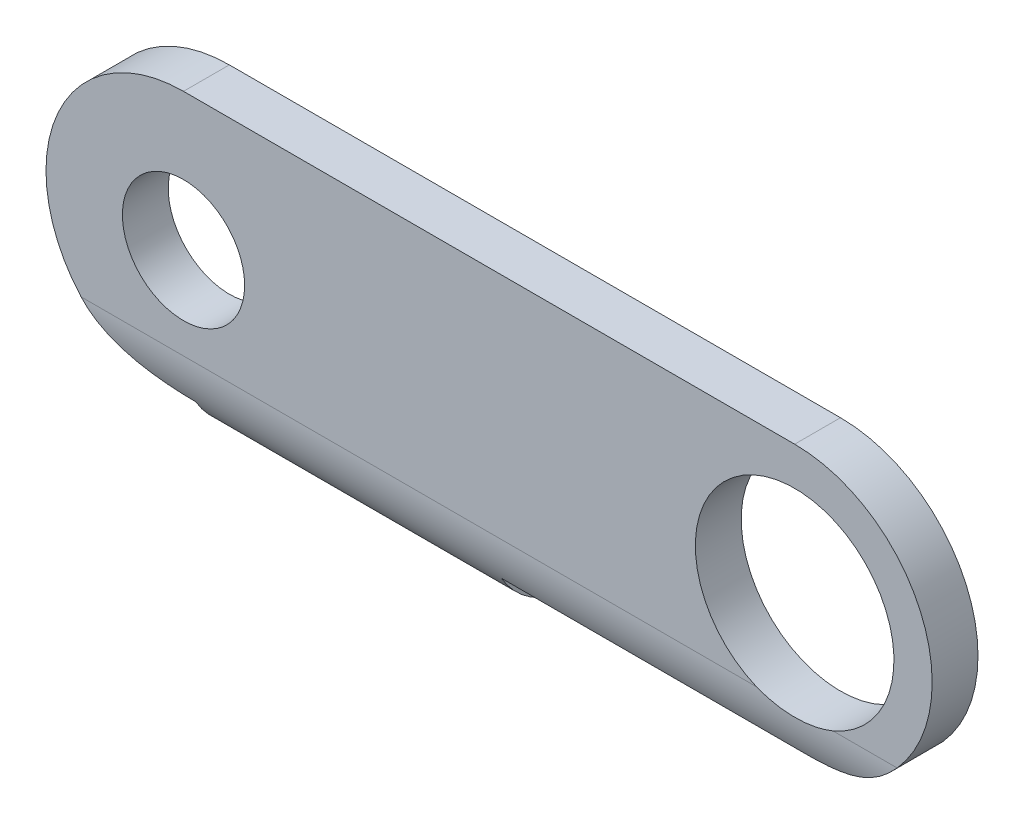
ISO-10303-21;
HEADER;
FILE_DESCRIPTION(('STEP AP214'),'2;1');
FILE_NAME('part.step','',(''),(''),'','','');
FILE_SCHEMA(('AUTOMOTIVE_DESIGN { 1 0 10303 214 1 1 1 1 }'));
ENDSEC;
DATA;
#1=APPLICATION_CONTEXT('core data for automotive mechanical design processes');
#2=APPLICATION_PROTOCOL_DEFINITION('international standard','automotive_design',2000,#1);
#3=PRODUCT_CONTEXT('',#1,'mechanical');
#4=PRODUCT('Part','Part','',(#3));
#5=PRODUCT_RELATED_PRODUCT_CATEGORY('part','',(#4));
#6=PRODUCT_DEFINITION_FORMATION('','',#4);
#7=PRODUCT_DEFINITION_CONTEXT('part definition',#1,'design');
#8=PRODUCT_DEFINITION('design','',#6,#7);
#9=PRODUCT_DEFINITION_SHAPE('','',#8);
#10=(LENGTH_UNIT() NAMED_UNIT(*) SI_UNIT(.MILLI.,.METRE.));
#11=(NAMED_UNIT(*) PLANE_ANGLE_UNIT() SI_UNIT($,.RADIAN.));
#12=(NAMED_UNIT(*) SI_UNIT($,.STERADIAN.) SOLID_ANGLE_UNIT());
#13=UNCERTAINTY_MEASURE_WITH_UNIT(LENGTH_MEASURE(1.E-05),#10,'distance_accuracy_value','');
#14=(GEOMETRIC_REPRESENTATION_CONTEXT(3) GLOBAL_UNCERTAINTY_ASSIGNED_CONTEXT((#13)) GLOBAL_UNIT_ASSIGNED_CONTEXT((#10,
#11,#12)) REPRESENTATION_CONTEXT('',''));
#15=CARTESIAN_POINT('',(0.,0.,0.));
#16=DIRECTION('',(0.,0.,1.));
#17=DIRECTION('',(1.,0.,0.));
#18=AXIS2_PLACEMENT_3D('',#15,#16,#17);
#19=CARTESIAN_POINT('',(-20.,0.,1.5));
#20=DIRECTION('',(0.,0.,1.));
#21=DIRECTION('',(1.,0.,0.));
#22=AXIS2_PLACEMENT_3D('',#19,#20,#21);
#23=PLANE('',#22);
#24=CARTESIAN_POINT('',(-20.,0.,1.5));
#25=DIRECTION('',(0.,0.,1.));
#26=DIRECTION('',(1.,0.,0.));
#27=AXIS2_PLACEMENT_3D('',#24,#25,#26);
#28=CIRCLE('',#27,4.5);
#29=CARTESIAN_POINT('',(-20.,4.5,1.5));
#30=VERTEX_POINT('',#29);
#31=CARTESIAN_POINT('',(-23.3541019662497,-3.,1.5));
#32=VERTEX_POINT('',#31);
#33=EDGE_CURVE('E183',#30,#32,#28,.T.);
#34=ORIENTED_EDGE('',*,*,#33,.T.);
#35=DIRECTION('',(1.,0.,0.));
#36=VECTOR('',#35,1.);
#37=CARTESIAN_POINT('',(-20.,-3.,1.5));
#38=LINE('',#37,#36);
#39=CARTESIAN_POINT('',(-1.25,-3.,1.5));
#40=VERTEX_POINT('',#39);
#41=EDGE_CURVE('E220',#32,#40,#38,.T.);
#42=ORIENTED_EDGE('',*,*,#41,.T.);
#43=CARTESIAN_POINT('',(0.,0.,1.5));
#44=DIRECTION('',(0.,0.,1.));
#45=DIRECTION('',(1.,0.,0.));
#46=AXIS2_PLACEMENT_3D('',#43,#44,#45);
#47=CIRCLE('',#46,3.25);
#48=CARTESIAN_POINT('',(1.25,-3.,1.5));
#49=VERTEX_POINT('',#48);
#50=EDGE_CURVE('E168',#49,#40,#47,.T.);
#51=ORIENTED_EDGE('',*,*,#50,.F.);
#52=DIRECTION('',(1.,0.,0.));
#53=VECTOR('',#52,1.);
#54=CARTESIAN_POINT('',(-20.,-3.,1.5));
#55=LINE('',#54,#53);
#56=CARTESIAN_POINT('',(3.35410196624968,-3.,1.5));
#57=VERTEX_POINT('',#56);
#58=EDGE_CURVE('E218',#49,#57,#55,.T.);
#59=ORIENTED_EDGE('',*,*,#58,.T.);
#60=CARTESIAN_POINT('',(0.,0.,1.5));
#61=DIRECTION('',(0.,0.,1.));
#62=DIRECTION('',(1.,0.,0.));
#63=AXIS2_PLACEMENT_3D('',#60,#61,#62);
#64=CIRCLE('',#63,4.5);
#65=CARTESIAN_POINT('',(0.,4.5,1.5));
#66=VERTEX_POINT('',#65);
#67=EDGE_CURVE('E308',#57,#66,#64,.T.);
#68=ORIENTED_EDGE('',*,*,#67,.T.);
#69=DIRECTION('',(-1.,0.,0.));
#70=VECTOR('',#69,1.);
#71=CARTESIAN_POINT('',(0.,4.5,1.5));
#72=LINE('',#71,#70);
#73=EDGE_CURVE('E177',#66,#30,#72,.T.);
#74=ORIENTED_EDGE('',*,*,#73,.T.);
#75=EDGE_LOOP('',(#34,#42,#51,#59,#68,#74));
#76=FACE_BOUND('',#75,.T.);
#77=CARTESIAN_POINT('',(-20.,0.,1.5));
#78=DIRECTION('',(0.,0.,1.));
#79=DIRECTION('',(1.,0.,0.));
#80=AXIS2_PLACEMENT_3D('',#77,#78,#79);
#81=CIRCLE('',#80,2.);
#82=CARTESIAN_POINT('',(-18.,0.,1.5));
#83=VERTEX_POINT('',#82);
#84=EDGE_CURVE('E291',#83,#83,#81,.T.);
#85=ORIENTED_EDGE('',*,*,#84,.F.);
#86=EDGE_LOOP('',(#85));
#87=FACE_BOUND('',#86,.T.);
#88=ADVANCED_FACE('F34',(#76,#87),#23,.T.);
#89=CARTESIAN_POINT('',(-20.,0.,0.));
#90=DIRECTION('',(0.,0.,1.));
#91=DIRECTION('',(1.,0.,0.));
#92=AXIS2_PLACEMENT_3D('',#89,#90,#91);
#93=PLANE('',#92);
#94=DIRECTION('',(1.,0.,0.));
#95=VECTOR('',#94,1.);
#96=CARTESIAN_POINT('',(0.,-4.5,0.));
#97=LINE('',#96,#95);
#98=CARTESIAN_POINT('',(-10.,-4.5,0.));
#99=VERTEX_POINT('',#98);
#100=CARTESIAN_POINT('',(0.,-4.5,0.));
#101=VERTEX_POINT('',#100);
#102=EDGE_CURVE('E167',#99,#101,#97,.T.);
#103=ORIENTED_EDGE('',*,*,#102,.F.);
#104=DIRECTION('',(0.,1.,0.));
#105=VECTOR('',#104,1.);
#106=CARTESIAN_POINT('',(-10.,0.,0.));
#107=LINE('',#106,#105);
#108=CARTESIAN_POINT('',(-10.,-3.,0.));
#109=VERTEX_POINT('',#108);
#110=EDGE_CURVE('E50',#99,#109,#107,.T.);
#111=ORIENTED_EDGE('',*,*,#110,.T.);
#112=DIRECTION('',(1.,0.,0.));
#113=VECTOR('',#112,1.);
#114=CARTESIAN_POINT('',(-20.,-3.,0.));
#115=LINE('',#114,#113);
#116=CARTESIAN_POINT('',(-20.,-3.,0.));
#117=VERTEX_POINT('',#116);
#118=EDGE_CURVE('E145',#109,#117,#115,.F.);
#119=ORIENTED_EDGE('',*,*,#118,.T.);
#120=DIRECTION('',(0.,-1.,0.));
#121=VECTOR('',#120,1.);
#122=CARTESIAN_POINT('',(-20.,0.,0.));
#123=LINE('',#122,#121);
#124=CARTESIAN_POINT('',(-20.,-4.5,0.));
#125=VERTEX_POINT('',#124);
#126=EDGE_CURVE('E137',#117,#125,#123,.T.);
#127=ORIENTED_EDGE('',*,*,#126,.T.);
#128=CARTESIAN_POINT('',(-20.,0.,0.));
#129=DIRECTION('',(0.,0.,1.));
#130=DIRECTION('',(1.,0.,0.));
#131=AXIS2_PLACEMENT_3D('',#128,#129,#130);
#132=CIRCLE('',#131,4.5);
#133=CARTESIAN_POINT('',(-20.,4.5,0.));
#134=VERTEX_POINT('',#133);
#135=EDGE_CURVE('E143',#134,#125,#132,.T.);
#136=ORIENTED_EDGE('',*,*,#135,.F.);
#137=DIRECTION('',(-1.,0.,0.));
#138=VECTOR('',#137,1.);
#139=CARTESIAN_POINT('',(0.,4.5,0.));
#140=LINE('',#139,#138);
#141=CARTESIAN_POINT('',(0.,4.5,0.));
#142=VERTEX_POINT('',#141);
#143=EDGE_CURVE('E181',#142,#134,#140,.T.);
#144=ORIENTED_EDGE('',*,*,#143,.F.);
#145=CARTESIAN_POINT('',(0.,0.,0.));
#146=DIRECTION('',(0.,0.,1.));
#147=DIRECTION('',(1.,0.,0.));
#148=AXIS2_PLACEMENT_3D('',#145,#146,#147);
#149=CIRCLE('',#148,4.5);
#150=EDGE_CURVE('E171',#101,#142,#149,.T.);
#151=ORIENTED_EDGE('',*,*,#150,.F.);
#152=EDGE_LOOP('',(#103,#111,#119,#127,#136,#144,#151));
#153=FACE_BOUND('',#152,.T.);
#154=CARTESIAN_POINT('',(0.,0.,0.));
#155=DIRECTION('',(0.,0.,1.));
#156=DIRECTION('',(1.,0.,0.));
#157=AXIS2_PLACEMENT_3D('',#154,#155,#156);
#158=CIRCLE('',#157,3.25);
#159=CARTESIAN_POINT('',(3.25,0.,0.));
#160=VERTEX_POINT('',#159);
#161=EDGE_CURVE('E174',#160,#160,#158,.T.);
#162=ORIENTED_EDGE('',*,*,#161,.T.);
#163=EDGE_LOOP('',(#162));
#164=FACE_BOUND('',#163,.T.);
#165=CARTESIAN_POINT('',(-20.,0.,0.));
#166=DIRECTION('',(0.,0.,1.));
#167=DIRECTION('',(1.,0.,0.));
#168=AXIS2_PLACEMENT_3D('',#165,#166,#167);
#169=CIRCLE('',#168,2.);
#170=CARTESIAN_POINT('',(-18.,0.,0.));
#171=VERTEX_POINT('',#170);
#172=EDGE_CURVE('E288',#171,#171,#169,.T.);
#173=ORIENTED_EDGE('',*,*,#172,.T.);
#174=EDGE_LOOP('',(#173));
#175=FACE_BOUND('',#174,.T.);
#176=ADVANCED_FACE('F139',(#153,#164,#175),#93,.F.);
#177=CARTESIAN_POINT('',(-20.,0.,1.5));
#178=DIRECTION('',(0.,0.,-1.));
#179=DIRECTION('',(-1.,0.,0.));
#180=AXIS2_PLACEMENT_3D('',#177,#178,#179);
#181=CYLINDRICAL_SURFACE('',#180,4.5);
#182=DIRECTION('',(0.,0.,-1.));
#183=VECTOR('',#182,1.);
#184=CARTESIAN_POINT('',(-20.,-4.5,1.5));
#185=LINE('',#184,#183);
#186=CARTESIAN_POINT('',(-20.,-4.5,1.09807621135332));
#187=VERTEX_POINT('',#186);
#188=EDGE_CURVE('E151',#187,#125,#185,.T.);
#189=ORIENTED_EDGE('',*,*,#188,.F.);
#190=CARTESIAN_POINT('',(-20.,-4.5,1.09807621135332));
#191=CARTESIAN_POINT('',(-20.0641724640907,-4.50000068850126,1.09807112169611));
#192=CARTESIAN_POINT('',(-20.1283341172951,-4.49862698733164,1.09886944184828));
#193=CARTESIAN_POINT('',(-20.2564950372864,-4.4931418331991,1.1020265701737));
#194=CARTESIAN_POINT('',(-20.3204943209628,-4.48903067777527,1.10438520875281));
#195=CARTESIAN_POINT('',(-20.5118761362115,-4.47262274917575,1.11372349156231));
#196=CARTESIAN_POINT('',(-20.6388266000457,-4.45625144242073,1.1229657585114));
#197=CARTESIAN_POINT('',(-20.8900453169576,-4.41293965403809,1.14654489222367));
#198=CARTESIAN_POINT('',(-21.014319695638,-4.38602681585234,1.16086842500732));
#199=CARTESIAN_POINT('',(-21.2597090555236,-4.32194615380094,1.19327785566076));
#200=CARTESIAN_POINT('',(-21.3808233923648,-4.28477625603227,1.21136451422514));
#201=CARTESIAN_POINT('',(-21.6081424623824,-4.20440630315293,1.24793849882478));
#202=CARTESIAN_POINT('',(-21.7146893999785,-4.16208318926146,1.26623368491333));
#203=CARTESIAN_POINT('',(-21.9241381177922,-4.06949832917731,1.30333038515384));
#204=CARTESIAN_POINT('',(-22.0270400705156,-4.01923695929374,1.32213187526967));
#205=CARTESIAN_POINT('',(-22.3293810282246,-3.8569632024236,1.37726451184091));
#206=CARTESIAN_POINT('',(-22.523007436984,-3.73326554588976,1.41242529052274));
#207=CARTESIAN_POINT('',(-22.8233288096184,-3.50715657645597,1.45817935639938));
#208=CARTESIAN_POINT('',(-22.9359821062857,-3.41342460973425,1.47305596685271));
#209=CARTESIAN_POINT('',(-23.1522128483185,-3.21483929795824,1.4939604058134));
#210=CARTESIAN_POINT('',(-23.2557751295736,-3.10996799259741,1.49997370423498));
#211=CARTESIAN_POINT('',(-23.3541019662497,-3.,1.5));
#212=B_SPLINE_CURVE_WITH_KNOTS('',3,(#190,#191,#192,#193,#194,#195,#196,#197,#198,#199,#200,
#201,#202,#203,#204,#205,#206,#207,#208,#209,#210,#211),.UNSPECIFIED.,.F.,.F.,(4,2,2,2,2,2,2,2,
2,2,4),(0.,0.192476686160136,0.384932455079635,0.769294492862237,1.15265528033508,
1.53609363744458,1.88403077823483,2.23195143018446,2.92602566961861,3.36707240421595,
3.80884136846114),.UNSPECIFIED.);
#213=EDGE_CURVE('E266',#187,#32,#212,.T.);
#214=ORIENTED_EDGE('',*,*,#213,.T.);
#215=ORIENTED_EDGE('',*,*,#33,.F.);
#216=DIRECTION('',(0.,0.,-1.));
#217=VECTOR('',#216,1.);
#218=CARTESIAN_POINT('',(-20.,4.5,1.5));
#219=LINE('',#218,#217);
#220=EDGE_CURVE('E166',#30,#134,#219,.T.);
#221=ORIENTED_EDGE('',*,*,#220,.T.);
#222=ORIENTED_EDGE('',*,*,#135,.T.);
#223=EDGE_LOOP('',(#189,#214,#215,#221,#222));
#224=FACE_BOUND('',#223,.T.);
#225=ADVANCED_FACE('F163',(#224),#181,.T.);
#226=CARTESIAN_POINT('',(0.,-4.5,1.5));
#227=DIRECTION('',(0.,1.,0.));
#228=DIRECTION('',(-1.,0.,0.));
#229=AXIS2_PLACEMENT_3D('',#226,#227,#228);
#230=PLANE('',#229);
#231=DIRECTION('',(0.,0.,-1.));
#232=VECTOR('',#231,1.);
#233=CARTESIAN_POINT('',(0.,-4.5,1.5));
#234=LINE('',#233,#232);
#235=CARTESIAN_POINT('',(0.,-4.5,1.09807621135332));
#236=VERTEX_POINT('',#235);
#237=EDGE_CURVE('E160',#236,#101,#234,.T.);
#238=ORIENTED_EDGE('',*,*,#237,.F.);
#239=DIRECTION('',(1.,0.,0.));
#240=VECTOR('',#239,1.);
#241=CARTESIAN_POINT('',(0.,-4.5,1.09807621135332));
#242=LINE('',#241,#240);
#243=CARTESIAN_POINT('',(-10.,-4.5,1.09807621135332));
#244=VERTEX_POINT('',#243);
#245=EDGE_CURVE('E271',#236,#244,#242,.F.);
#246=ORIENTED_EDGE('',*,*,#245,.T.);
#247=DIRECTION('',(0.,0.,-1.));
#248=VECTOR('',#247,1.);
#249=CARTESIAN_POINT('',(-10.,-4.5,1.5));
#250=LINE('',#249,#248);
#251=EDGE_CURVE('E159',#244,#99,#250,.T.);
#252=ORIENTED_EDGE('',*,*,#251,.T.);
#253=ORIENTED_EDGE('',*,*,#102,.T.);
#254=EDGE_LOOP('',(#238,#246,#252,#253));
#255=FACE_BOUND('',#254,.T.);
#256=ADVANCED_FACE('F256',(#255),#230,.F.);
#257=CARTESIAN_POINT('',(0.,0.,1.5));
#258=DIRECTION('',(0.,0.,-1.));
#259=DIRECTION('',(-1.,0.,0.));
#260=AXIS2_PLACEMENT_3D('',#257,#258,#259);
#261=CYLINDRICAL_SURFACE('',#260,4.5);
#262=ORIENTED_EDGE('',*,*,#67,.F.);
#263=CARTESIAN_POINT('',(3.35410196624968,-3.,1.5));
#264=CARTESIAN_POINT('',(3.26843639465031,-3.09581532041757,1.49998930565367));
#265=CARTESIAN_POINT('',(3.17872356545253,-3.18782222315352,1.49541315966271));
#266=CARTESIAN_POINT('',(2.99226605349355,-3.3634286034175,1.47921005181062));
#267=CARTESIAN_POINT('',(2.89553362813502,-3.44704215618534,1.46759513191858));
#268=CARTESIAN_POINT('',(2.69591571838449,-3.60531164677196,1.43939661343817));
#269=CARTESIAN_POINT('',(2.59303742229788,-3.67997775376376,1.42281873193543));
#270=CARTESIAN_POINT('',(2.38169036284963,-3.8201611424186,1.38662042309605));
#271=CARTESIAN_POINT('',(2.27321963188368,-3.88567517358713,1.36699891996753));
#272=CARTESIAN_POINT('',(2.06291298490798,-4.00090376568682,1.32868932515649));
#273=CARTESIAN_POINT('',(1.96156592771231,-4.05155363374526,1.31011750331438));
#274=CARTESIAN_POINT('',(1.75529835087639,-4.14508713765425,1.27331954950032));
#275=CARTESIAN_POINT('',(1.65037828587286,-4.18797175721649,1.25509337400372));
#276=CARTESIAN_POINT('',(1.43757400398673,-4.26569908454202,1.22026044139867));
#277=CARTESIAN_POINT('',(1.32969597118536,-4.30055732269776,1.20365059342241));
#278=CARTESIAN_POINT('',(1.11126161267794,-4.36210543638089,1.1731725423528));
#279=CARTESIAN_POINT('',(1.00070592959035,-4.38879725123896,1.15930368861612));
#280=CARTESIAN_POINT('',(0.816329078798757,-4.42596011751043,1.13949074542775));
#281=CARTESIAN_POINT('',(0.743101372017233,-4.43884419090235,1.13246791125873));
#282=CARTESIAN_POINT('',(0.595958474666452,-4.46098270222667,1.12024605306187));
#283=CARTESIAN_POINT('',(0.522043432332093,-4.47023790501299,1.11504664473656));
#284=CARTESIAN_POINT('',(0.373578078581113,-4.48508800329872,1.10664357905802));
#285=CARTESIAN_POINT('',(0.29902676949472,-4.49067528925098,1.10344407139953));
#286=CARTESIAN_POINT('',(0.149651589845074,-4.4981337384665,1.09915341395771));
#287=CARTESIAN_POINT('',(0.0748276307733984,-4.50000356238319,1.09806302406214));
#288=CARTESIAN_POINT('',(0.,-4.5,1.09807621135332));
#289=B_SPLINE_CURVE_WITH_KNOTS('',3,(#263,#264,#265,#266,#267,#268,#269,#270,#271,#272,#273,
#274,#275,#276,#277,#278,#279,#280,#281,#282,#283,#284,#285,#286,#287,#288),.UNSPECIFIED.,.F.,
.F.,(4,2,2,2,2,2,2,2,2,2,2,2,4),(0.,0.385181042459184,0.769704968314894,1.15378763504487,
1.53800636944876,1.8821301413876,2.22621028873717,2.56961896711781,2.91294603071872,
3.13689493439012,3.36079661113944,3.58516134383879,3.80960689719306),.UNSPECIFIED.);
#290=EDGE_CURVE('E58',#57,#236,#289,.T.);
#291=ORIENTED_EDGE('',*,*,#290,.T.);
#292=ORIENTED_EDGE('',*,*,#237,.T.);
#293=ORIENTED_EDGE('',*,*,#150,.T.);
#294=DIRECTION('',(0.,0.,-1.));
#295=VECTOR('',#294,1.);
#296=CARTESIAN_POINT('',(0.,4.5,1.5));
#297=LINE('',#296,#295);
#298=EDGE_CURVE('E185',#66,#142,#297,.T.);
#299=ORIENTED_EDGE('',*,*,#298,.F.);
#300=EDGE_LOOP('',(#262,#291,#292,#293,#299));
#301=FACE_BOUND('',#300,.T.);
#302=ADVANCED_FACE('F251',(#301),#261,.T.);
#303=CARTESIAN_POINT('',(0.,4.5,1.5));
#304=DIRECTION('',(0.,-1.,0.));
#305=DIRECTION('',(1.,0.,0.));
#306=AXIS2_PLACEMENT_3D('',#303,#304,#305);
#307=PLANE('',#306);
#308=ORIENTED_EDGE('',*,*,#143,.T.);
#309=ORIENTED_EDGE('',*,*,#220,.F.);
#310=ORIENTED_EDGE('',*,*,#73,.F.);
#311=ORIENTED_EDGE('',*,*,#298,.T.);
#312=EDGE_LOOP('',(#308,#309,#310,#311));
#313=FACE_BOUND('',#312,.T.);
#314=ADVANCED_FACE('F242',(#313),#307,.F.);
#315=CARTESIAN_POINT('',(0.,0.,1.5));
#316=DIRECTION('',(0.,0.,-1.));
#317=DIRECTION('',(-1.,0.,0.));
#318=AXIS2_PLACEMENT_3D('',#315,#316,#317);
#319=CYLINDRICAL_SURFACE('',#318,3.25);
#320=ORIENTED_EDGE('',*,*,#50,.T.);
#321=CARTESIAN_POINT('',(-1.25,-3.,1.5));
#322=CARTESIAN_POINT('',(-1.16574554035281,-3.03511631353324,1.49997505278138));
#323=CARTESIAN_POINT('',(-1.08001054114574,-3.06666339462325,1.49938227957848));
#324=CARTESIAN_POINT('',(-0.906197254977548,-3.12243820341659,1.49763703051949));
#325=CARTESIAN_POINT('',(-0.818118983899914,-3.1466659807189,1.49648455845631));
#326=CARTESIAN_POINT('',(-0.640190001238086,-3.18763231591128,1.49419525594888));
#327=CARTESIAN_POINT('',(-0.550338400575452,-3.20436701207117,1.49305843386205));
#328=CARTESIAN_POINT('',(-0.369546087640031,-3.23021242473211,1.49118259715925));
#329=CARTESIAN_POINT('',(-0.278605439940629,-3.23932359101068,1.49044355907551));
#330=CARTESIAN_POINT('',(-0.0962017814521971,-3.24986122320275,1.48958137537726));
#331=CARTESIAN_POINT('',(-0.00473840248085212,-3.25128136103484,1.48945873693459));
#332=CARTESIAN_POINT('',(0.177981364485658,-3.24640952697439,1.48986428353105));
#333=CARTESIAN_POINT('',(0.269237753147712,-3.24011757996437,1.49039246647036));
#334=CARTESIAN_POINT('',(0.450730053217876,-3.21988600983439,1.49194793668579));
#335=CARTESIAN_POINT('',(0.540967472254486,-3.20595980326978,1.49297434800695));
#336=CARTESIAN_POINT('',(0.719913743999114,-3.17057362500535,1.4951992115434));
#337=CARTESIAN_POINT('',(0.80862329726755,-3.14911720806085,1.49639758242494));
#338=CARTESIAN_POINT('',(0.956387476158915,-3.10672446727082,1.49815062215451));
#339=CARTESIAN_POINT('',(1.01600844169022,-3.08773980423882,1.49878926345965));
#340=CARTESIAN_POINT('',(1.13398071532714,-3.04638985097484,1.49971132043639));
#341=CARTESIAN_POINT('',(1.1923335916818,-3.02402904448411,1.49999520268058));
#342=CARTESIAN_POINT('',(1.25,-3.,1.5));
#343=B_SPLINE_CURVE_WITH_KNOTS('',3,(#321,#322,#323,#324,#325,#326,#327,#328,#329,#330,#331,
#332,#333,#334,#335,#336,#337,#338,#339,#340,#341,#342),.UNSPECIFIED.,.F.,.F.,(4,2,2,2,2,2,2,2,
2,2,4),(0.,0.273747787364378,0.547493719646099,0.821380571204313,1.0952512626846,
1.3693472573267,1.64344236761848,1.91705731639561,2.19054327424784,2.37816618656371,
2.56554208008817),.UNSPECIFIED.);
#344=EDGE_CURVE('E223',#40,#49,#343,.T.);
#345=ORIENTED_EDGE('',*,*,#344,.T.);
#346=EDGE_LOOP('',(#320,#345));
#347=FACE_BOUND('',#346,.T.);
#348=ORIENTED_EDGE('',*,*,#161,.F.);
#349=EDGE_LOOP('',(#348));
#350=FACE_BOUND('',#349,.T.);
#351=ADVANCED_FACE('F236',(#347,#350),#319,.F.);
#352=CARTESIAN_POINT('',(-20.,0.,1.5));
#353=DIRECTION('',(0.,0.,-1.));
#354=DIRECTION('',(-1.,0.,0.));
#355=AXIS2_PLACEMENT_3D('',#352,#353,#354);
#356=CYLINDRICAL_SURFACE('',#355,2.);
#357=ORIENTED_EDGE('',*,*,#84,.T.);
#358=EDGE_LOOP('',(#357));
#359=FACE_BOUND('',#358,.T.);
#360=ORIENTED_EDGE('',*,*,#172,.F.);
#361=EDGE_LOOP('',(#360));
#362=FACE_BOUND('',#361,.T.);
#363=ADVANCED_FACE('F241',(#359,#362),#356,.F.);
#364=CARTESIAN_POINT('',(-20.,-4.5,-4.5));
#365=DIRECTION('',(0.,1.,0.));
#366=DIRECTION('',(0.,0.,1.));
#367=AXIS2_PLACEMENT_3D('',#364,#365,#366);
#368=PLANE('',#367);
#369=DIRECTION('',(0.,0.,1.));
#370=VECTOR('',#369,1.);
#371=CARTESIAN_POINT('',(-10.,-4.5,-4.5));
#372=LINE('',#371,#370);
#373=CARTESIAN_POINT('',(-10.,-4.5,-3.5));
#374=VERTEX_POINT('',#373);
#375=CARTESIAN_POINT('',(-10.,-4.5,-1.5));
#376=VERTEX_POINT('',#375);
#377=EDGE_CURVE('E276',#374,#376,#372,.T.);
#378=ORIENTED_EDGE('',*,*,#377,.F.);
#379=CARTESIAN_POINT('',(-11.,-4.5,-3.5));
#380=DIRECTION('',(0.,1.,0.));
#381=DIRECTION('',(0.,0.,1.));
#382=AXIS2_PLACEMENT_3D('',#379,#380,#381);
#383=CIRCLE('',#382,1.);
#384=CARTESIAN_POINT('',(-11.,-4.5,-4.5));
#385=VERTEX_POINT('',#384);
#386=EDGE_CURVE('E201',#374,#385,#383,.T.);
#387=ORIENTED_EDGE('',*,*,#386,.T.);
#388=DIRECTION('',(-1.,0.,0.));
#389=VECTOR('',#388,1.);
#390=CARTESIAN_POINT('',(-20.,-4.5,-4.5));
#391=LINE('',#390,#389);
#392=CARTESIAN_POINT('',(-19.,-4.5,-4.5));
#393=VERTEX_POINT('',#392);
#394=EDGE_CURVE('E296',#385,#393,#391,.T.);
#395=ORIENTED_EDGE('',*,*,#394,.T.);
#396=CARTESIAN_POINT('',(-19.,-4.5,-3.5));
#397=DIRECTION('',(0.,1.,0.));
#398=DIRECTION('',(0.,0.,1.));
#399=AXIS2_PLACEMENT_3D('',#396,#397,#398);
#400=CIRCLE('',#399,1.);
#401=CARTESIAN_POINT('',(-20.,-4.5,-3.5));
#402=VERTEX_POINT('',#401);
#403=EDGE_CURVE('E199',#393,#402,#400,.T.);
#404=ORIENTED_EDGE('',*,*,#403,.T.);
#405=DIRECTION('',(0.,0.,1.));
#406=VECTOR('',#405,1.);
#407=CARTESIAN_POINT('',(-20.,-4.5,-4.5));
#408=LINE('',#407,#406);
#409=CARTESIAN_POINT('',(-20.,-4.5,-1.5));
#410=VERTEX_POINT('',#409);
#411=EDGE_CURVE('E282',#402,#410,#408,.T.);
#412=ORIENTED_EDGE('',*,*,#411,.T.);
#413=DIRECTION('',(1.,0.,0.));
#414=VECTOR('',#413,1.);
#415=CARTESIAN_POINT('',(-20.,-4.5,-1.5));
#416=LINE('',#415,#414);
#417=EDGE_CURVE('E196',#410,#376,#416,.T.);
#418=ORIENTED_EDGE('',*,*,#417,.T.);
#419=EDGE_LOOP('',(#378,#387,#395,#404,#412,#418));
#420=FACE_BOUND('',#419,.T.);
#421=ADVANCED_FACE('F285',(#420),#368,.T.);
#422=CARTESIAN_POINT('',(-20.,-6.,-4.5));
#423=DIRECTION('',(-1.,0.,0.));
#424=DIRECTION('',(0.,0.,1.));
#425=AXIS2_PLACEMENT_3D('',#422,#423,#424);
#426=PLANE('',#425);
#427=ORIENTED_EDGE('',*,*,#411,.F.);
#428=DIRECTION('',(0.,-1.,0.));
#429=VECTOR('',#428,1.);
#430=CARTESIAN_POINT('',(-20.,-6.,-3.5));
#431=LINE('',#430,#429);
#432=CARTESIAN_POINT('',(-20.,-6.,-3.5));
#433=VERTEX_POINT('',#432);
#434=EDGE_CURVE('E148',#402,#433,#431,.T.);
#435=ORIENTED_EDGE('',*,*,#434,.T.);
#436=DIRECTION('',(0.,0.,1.));
#437=VECTOR('',#436,1.);
#438=CARTESIAN_POINT('',(-20.,-6.,-4.5));
#439=LINE('',#438,#437);
#440=CARTESIAN_POINT('',(-20.,-6.,-1.5));
#441=VERTEX_POINT('',#440);
#442=EDGE_CURVE('E301',#433,#441,#439,.T.);
#443=ORIENTED_EDGE('',*,*,#442,.T.);
#444=CARTESIAN_POINT('',(-20.,-3.,-1.5));
#445=DIRECTION('',(-1.,0.,0.));
#446=DIRECTION('',(0.,0.,1.));
#447=AXIS2_PLACEMENT_3D('',#444,#445,#446);
#448=CIRCLE('',#447,3.);
#449=EDGE_CURVE('E156',#441,#187,#448,.T.);
#450=ORIENTED_EDGE('',*,*,#449,.T.);
#451=ORIENTED_EDGE('',*,*,#188,.T.);
#452=ORIENTED_EDGE('',*,*,#126,.F.);
#453=CARTESIAN_POINT('',(-20.,-3.,-1.5));
#454=DIRECTION('',(-1.,0.,0.));
#455=DIRECTION('',(0.,0.,1.));
#456=AXIS2_PLACEMENT_3D('',#453,#454,#455);
#457=CIRCLE('',#456,1.5);
#458=EDGE_CURVE('E12',#117,#410,#457,.F.);
#459=ORIENTED_EDGE('',*,*,#458,.T.);
#460=EDGE_LOOP('',(#427,#435,#443,#450,#451,#452,#459));
#461=FACE_BOUND('',#460,.T.);
#462=ADVANCED_FACE('F153',(#461),#426,.T.);
#463=CARTESIAN_POINT('',(-10.,-6.,-4.5));
#464=DIRECTION('',(1.,0.,0.));
#465=DIRECTION('',(0.,0.,-1.));
#466=AXIS2_PLACEMENT_3D('',#463,#464,#465);
#467=PLANE('',#466);
#468=DIRECTION('',(0.,0.,1.));
#469=VECTOR('',#468,1.);
#470=CARTESIAN_POINT('',(-10.,-6.,-4.5));
#471=LINE('',#470,#469);
#472=CARTESIAN_POINT('',(-10.,-6.,-3.5));
#473=VERTEX_POINT('',#472);
#474=CARTESIAN_POINT('',(-10.,-6.,-1.5));
#475=VERTEX_POINT('',#474);
#476=EDGE_CURVE('E293',#473,#475,#471,.T.);
#477=ORIENTED_EDGE('',*,*,#476,.F.);
#478=DIRECTION('',(0.,1.,0.));
#479=VECTOR('',#478,1.);
#480=CARTESIAN_POINT('',(-10.,-6.,-3.5));
#481=LINE('',#480,#479);
#482=EDGE_CURVE('E193',#473,#374,#481,.T.);
#483=ORIENTED_EDGE('',*,*,#482,.T.);
#484=ORIENTED_EDGE('',*,*,#377,.T.);
#485=CARTESIAN_POINT('',(-10.,-3.,-1.5));
#486=DIRECTION('',(1.,0.,0.));
#487=DIRECTION('',(0.,0.,-1.));
#488=AXIS2_PLACEMENT_3D('',#485,#486,#487);
#489=CIRCLE('',#488,1.5);
#490=EDGE_CURVE('E43',#376,#109,#489,.F.);
#491=ORIENTED_EDGE('',*,*,#490,.T.);
#492=ORIENTED_EDGE('',*,*,#110,.F.);
#493=ORIENTED_EDGE('',*,*,#251,.F.);
#494=CARTESIAN_POINT('',(-10.,-3.,-1.5));
#495=DIRECTION('',(1.,0.,0.));
#496=DIRECTION('',(0.,0.,-1.));
#497=AXIS2_PLACEMENT_3D('',#494,#495,#496);
#498=CIRCLE('',#497,3.);
#499=EDGE_CURVE('E191',#244,#475,#498,.T.);
#500=ORIENTED_EDGE('',*,*,#499,.T.);
#501=EDGE_LOOP('',(#477,#483,#484,#491,#492,#493,#500));
#502=FACE_BOUND('',#501,.T.);
#503=ADVANCED_FACE('F274',(#502),#467,.T.);
#504=CARTESIAN_POINT('',(-20.,-6.,-4.5));
#505=DIRECTION('',(0.,-1.,0.));
#506=DIRECTION('',(0.,0.,-1.));
#507=AXIS2_PLACEMENT_3D('',#504,#505,#506);
#508=PLANE('',#507);
#509=DIRECTION('',(1.,0.,0.));
#510=VECTOR('',#509,1.);
#511=CARTESIAN_POINT('',(-20.,-6.,-4.5));
#512=LINE('',#511,#510);
#513=CARTESIAN_POINT('',(-19.,-6.,-4.5));
#514=VERTEX_POINT('',#513);
#515=CARTESIAN_POINT('',(-11.,-6.,-4.5));
#516=VERTEX_POINT('',#515);
#517=EDGE_CURVE('E346',#514,#516,#512,.T.);
#518=ORIENTED_EDGE('',*,*,#517,.T.);
#519=CARTESIAN_POINT('',(-11.,-6.,-3.5));
#520=DIRECTION('',(0.,-1.,0.));
#521=DIRECTION('',(0.,0.,-1.));
#522=AXIS2_PLACEMENT_3D('',#519,#520,#521);
#523=CIRCLE('',#522,1.);
#524=EDGE_CURVE('E211',#516,#473,#523,.T.);
#525=ORIENTED_EDGE('',*,*,#524,.T.);
#526=ORIENTED_EDGE('',*,*,#476,.T.);
#527=DIRECTION('',(1.,0.,0.));
#528=VECTOR('',#527,1.);
#529=CARTESIAN_POINT('',(-20.,-6.,-1.5));
#530=LINE('',#529,#528);
#531=EDGE_CURVE('E207',#475,#441,#530,.F.);
#532=ORIENTED_EDGE('',*,*,#531,.T.);
#533=ORIENTED_EDGE('',*,*,#442,.F.);
#534=CARTESIAN_POINT('',(-19.,-6.,-3.5));
#535=DIRECTION('',(0.,-1.,0.));
#536=DIRECTION('',(0.,0.,-1.));
#537=AXIS2_PLACEMENT_3D('',#534,#535,#536);
#538=CIRCLE('',#537,1.);
#539=EDGE_CURVE('E209',#433,#514,#538,.T.);
#540=ORIENTED_EDGE('',*,*,#539,.T.);
#541=EDGE_LOOP('',(#518,#525,#526,#532,#533,#540));
#542=FACE_BOUND('',#541,.T.);
#543=ADVANCED_FACE('F337',(#542),#508,.T.);
#544=CARTESIAN_POINT('',(0.,0.,-4.5));
#545=DIRECTION('',(0.,0.,-1.));
#546=DIRECTION('',(-1.,0.,0.));
#547=AXIS2_PLACEMENT_3D('',#544,#545,#546);
#548=PLANE('',#547);
#549=ORIENTED_EDGE('',*,*,#394,.F.);
#550=DIRECTION('',(0.,1.,0.));
#551=VECTOR('',#550,1.);
#552=CARTESIAN_POINT('',(-11.,0.,-4.5));
#553=LINE('',#552,#551);
#554=EDGE_CURVE('E205',#385,#516,#553,.F.);
#555=ORIENTED_EDGE('',*,*,#554,.T.);
#556=ORIENTED_EDGE('',*,*,#517,.F.);
#557=DIRECTION('',(0.,-1.,0.));
#558=VECTOR('',#557,1.);
#559=CARTESIAN_POINT('',(-19.,0.,-4.5));
#560=LINE('',#559,#558);
#561=EDGE_CURVE('E203',#514,#393,#560,.F.);
#562=ORIENTED_EDGE('',*,*,#561,.T.);
#563=EDGE_LOOP('',(#549,#555,#556,#562));
#564=FACE_BOUND('',#563,.T.);
#565=ADVANCED_FACE('F334',(#564),#548,.T.);
#566=CARTESIAN_POINT('',(-11.,-6.,-3.5));
#567=DIRECTION('',(0.,1.,0.));
#568=DIRECTION('',(0.,0.,1.));
#569=AXIS2_PLACEMENT_3D('',#566,#567,#568);
#570=CYLINDRICAL_SURFACE('',#569,1.);
#571=ORIENTED_EDGE('',*,*,#524,.F.);
#572=ORIENTED_EDGE('',*,*,#554,.F.);
#573=ORIENTED_EDGE('',*,*,#386,.F.);
#574=ORIENTED_EDGE('',*,*,#482,.F.);
#575=EDGE_LOOP('',(#571,#572,#573,#574));
#576=FACE_BOUND('',#575,.T.);
#577=ADVANCED_FACE('F263',(#576),#570,.T.);
#578=CARTESIAN_POINT('',(-19.,-6.,-3.5));
#579=DIRECTION('',(0.,-1.,0.));
#580=DIRECTION('',(0.,0.,-1.));
#581=AXIS2_PLACEMENT_3D('',#578,#579,#580);
#582=CYLINDRICAL_SURFACE('',#581,1.);
#583=ORIENTED_EDGE('',*,*,#403,.F.);
#584=ORIENTED_EDGE('',*,*,#561,.F.);
#585=ORIENTED_EDGE('',*,*,#539,.F.);
#586=ORIENTED_EDGE('',*,*,#434,.F.);
#587=EDGE_LOOP('',(#583,#584,#585,#586));
#588=FACE_BOUND('',#587,.T.);
#589=ADVANCED_FACE('F355',(#588),#582,.T.);
#590=CARTESIAN_POINT('',(-20.,-3.,-1.5));
#591=DIRECTION('',(1.,0.,0.));
#592=DIRECTION('',(0.,0.,-1.));
#593=AXIS2_PLACEMENT_3D('',#590,#591,#592);
#594=CYLINDRICAL_SURFACE('',#593,1.5);
#595=ORIENTED_EDGE('',*,*,#458,.F.);
#596=ORIENTED_EDGE('',*,*,#118,.F.);
#597=ORIENTED_EDGE('',*,*,#490,.F.);
#598=ORIENTED_EDGE('',*,*,#417,.F.);
#599=EDGE_LOOP('',(#595,#596,#597,#598));
#600=FACE_BOUND('',#599,.T.);
#601=ADVANCED_FACE('F280',(#600),#594,.F.);
#602=CARTESIAN_POINT('',(-20.,-3.,-1.5));
#603=DIRECTION('',(1.,0.,0.));
#604=DIRECTION('',(0.,0.,-1.));
#605=AXIS2_PLACEMENT_3D('',#602,#603,#604);
#606=CYLINDRICAL_SURFACE('',#605,3.);
#607=ORIENTED_EDGE('',*,*,#449,.F.);
#608=ORIENTED_EDGE('',*,*,#531,.F.);
#609=ORIENTED_EDGE('',*,*,#499,.F.);
#610=ORIENTED_EDGE('',*,*,#245,.F.);
#611=ORIENTED_EDGE('',*,*,#290,.F.);
#612=ORIENTED_EDGE('',*,*,#58,.F.);
#613=ORIENTED_EDGE('',*,*,#344,.F.);
#614=ORIENTED_EDGE('',*,*,#41,.F.);
#615=ORIENTED_EDGE('',*,*,#213,.F.);
#616=EDGE_LOOP('',(#607,#608,#609,#610,#611,#612,#613,#614,#615));
#617=FACE_BOUND('',#616,.T.);
#618=ADVANCED_FACE('F36',(#617),#606,.T.);
#619=CLOSED_SHELL('',(#88,#176,#225,#256,#302,#314,#351,#363,#421,#462,#503,#543,#565,#577,#589,
#601,#618));
#620=MANIFOLD_SOLID_BREP('B2',#619);
#621=ADVANCED_BREP_SHAPE_REPRESENTATION('',(#18,#620),#14);
#622=SHAPE_DEFINITION_REPRESENTATION(#9,#621);
ENDSEC;
END-ISO-10303-21;
